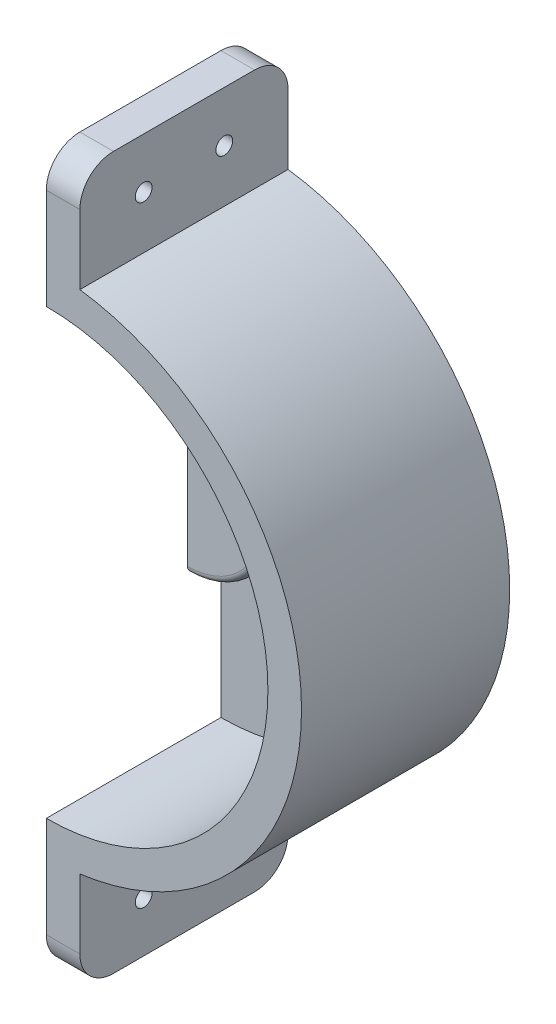
ISO-10303-21;
HEADER;
FILE_DESCRIPTION(('STEP AP214'),'2;1');
FILE_NAME('part.step','',(''),(''),'','','');
FILE_SCHEMA(('AUTOMOTIVE_DESIGN { 1 0 10303 214 1 1 1 1 }'));
ENDSEC;
DATA;
#1=APPLICATION_CONTEXT('core data for automotive mechanical design processes');
#2=APPLICATION_PROTOCOL_DEFINITION('international standard','automotive_design',2000,#1);
#3=PRODUCT_CONTEXT('',#1,'mechanical');
#4=PRODUCT('Part','Part','',(#3));
#5=PRODUCT_RELATED_PRODUCT_CATEGORY('part','',(#4));
#6=PRODUCT_DEFINITION_FORMATION('','',#4);
#7=PRODUCT_DEFINITION_CONTEXT('part definition',#1,'design');
#8=PRODUCT_DEFINITION('design','',#6,#7);
#9=PRODUCT_DEFINITION_SHAPE('','',#8);
#10=(LENGTH_UNIT() NAMED_UNIT(*) SI_UNIT(.MILLI.,.METRE.));
#11=(NAMED_UNIT(*) PLANE_ANGLE_UNIT() SI_UNIT($,.RADIAN.));
#12=(NAMED_UNIT(*) SI_UNIT($,.STERADIAN.) SOLID_ANGLE_UNIT());
#13=UNCERTAINTY_MEASURE_WITH_UNIT(LENGTH_MEASURE(1.E-05),#10,'distance_accuracy_value','');
#14=(GEOMETRIC_REPRESENTATION_CONTEXT(3) GLOBAL_UNCERTAINTY_ASSIGNED_CONTEXT((#13)) GLOBAL_UNIT_ASSIGNED_CONTEXT((#10,
#11,#12)) REPRESENTATION_CONTEXT('',''));
#15=CARTESIAN_POINT('',(0.,0.,0.));
#16=DIRECTION('',(0.,0.,1.));
#17=DIRECTION('',(1.,0.,0.));
#18=AXIS2_PLACEMENT_3D('',#15,#16,#17);
#19=CARTESIAN_POINT('',(0.,0.,5.));
#20=DIRECTION('',(0.,0.,-1.));
#21=DIRECTION('',(-1.,0.,0.));
#22=AXIS2_PLACEMENT_3D('',#19,#20,#21);
#23=CYLINDRICAL_SURFACE('',#22,38.);
#24=DIRECTION('',(0.,0.,-1.));
#25=VECTOR('',#24,1.);
#26=CARTESIAN_POINT('',(4.99999999999998,37.6696164036747,5.));
#27=LINE('',#26,#25);
#28=CARTESIAN_POINT('',(4.99999999999998,37.6696164036747,31.));
#29=VERTEX_POINT('',#28);
#30=CARTESIAN_POINT('',(4.99999999999998,37.6696164036747,0.));
#31=VERTEX_POINT('',#30);
#32=EDGE_CURVE('E139',#29,#31,#27,.T.);
#33=ORIENTED_EDGE('',*,*,#32,.F.);
#34=CARTESIAN_POINT('',(0.,0.,31.));
#35=DIRECTION('',(0.,0.,1.));
#36=DIRECTION('',(1.,0.,0.));
#37=AXIS2_PLACEMENT_3D('',#34,#35,#36);
#38=CIRCLE('',#37,38.);
#39=CARTESIAN_POINT('',(4.99999999999997,-37.6696164036747,31.));
#40=VERTEX_POINT('',#39);
#41=EDGE_CURVE('E143',#40,#29,#38,.T.);
#42=ORIENTED_EDGE('',*,*,#41,.F.);
#43=DIRECTION('',(0.,0.,-1.));
#44=VECTOR('',#43,1.);
#45=CARTESIAN_POINT('',(5.,-37.6696164036747,5.));
#46=LINE('',#45,#44);
#47=CARTESIAN_POINT('',(5.,-37.6696164036747,0.));
#48=VERTEX_POINT('',#47);
#49=EDGE_CURVE('E147',#40,#48,#46,.T.);
#50=ORIENTED_EDGE('',*,*,#49,.T.);
#51=CARTESIAN_POINT('',(0.,0.,0.));
#52=DIRECTION('',(0.,0.,1.));
#53=DIRECTION('',(1.,0.,0.));
#54=AXIS2_PLACEMENT_3D('',#51,#52,#53);
#55=CIRCLE('',#54,38.);
#56=EDGE_CURVE('E145',#48,#31,#55,.T.);
#57=ORIENTED_EDGE('',*,*,#56,.T.);
#58=EDGE_LOOP('',(#33,#42,#50,#57));
#59=FACE_BOUND('',#58,.T.);
#60=ADVANCED_FACE('F32',(#59),#23,.T.);
#61=CARTESIAN_POINT('',(0.,0.,5.));
#62=DIRECTION('',(0.,0.,1.));
#63=DIRECTION('',(1.,0.,0.));
#64=AXIS2_PLACEMENT_3D('',#61,#62,#63);
#65=PLANE('',#64);
#66=DIRECTION('',(0.,-1.,0.));
#67=VECTOR('',#66,1.);
#68=CARTESIAN_POINT('',(0.,38.,5.));
#69=LINE('',#68,#67);
#70=CARTESIAN_POINT('',(0.,33.,5.));
#71=VERTEX_POINT('',#70);
#72=CARTESIAN_POINT('',(0.,12.,5.));
#73=VERTEX_POINT('',#72);
#74=EDGE_CURVE('E188',#71,#73,#69,.T.);
#75=ORIENTED_EDGE('',*,*,#74,.T.);
#76=CARTESIAN_POINT('',(0.,0.,5.));
#77=DIRECTION('',(0.,0.,1.));
#78=DIRECTION('',(1.,0.,0.));
#79=AXIS2_PLACEMENT_3D('',#76,#77,#78);
#80=CIRCLE('',#79,12.);
#81=CARTESIAN_POINT('',(0.,-12.,5.));
#82=VERTEX_POINT('',#81);
#83=EDGE_CURVE('E516',#82,#73,#80,.T.);
#84=ORIENTED_EDGE('',*,*,#83,.F.);
#85=CARTESIAN_POINT('',(0.,-33.,5.));
#86=VERTEX_POINT('',#85);
#87=EDGE_CURVE('E186',#82,#86,#69,.T.);
#88=ORIENTED_EDGE('',*,*,#87,.T.);
#89=CARTESIAN_POINT('',(0.,0.,5.));
#90=DIRECTION('',(0.,0.,-1.));
#91=DIRECTION('',(1.,0.,0.));
#92=AXIS2_PLACEMENT_3D('',#89,#90,#91);
#93=CIRCLE('',#92,33.);
#94=EDGE_CURVE('E166',#71,#86,#93,.T.);
#95=ORIENTED_EDGE('',*,*,#94,.F.);
#96=EDGE_LOOP('',(#75,#84,#88,#95));
#97=FACE_BOUND('',#96,.T.);
#98=ADVANCED_FACE('F290',(#97),#65,.T.);
#99=CARTESIAN_POINT('',(0.,53.,5.));
#100=DIRECTION('',(0.,-1.,0.));
#101=DIRECTION('',(0.,0.,-1.));
#102=AXIS2_PLACEMENT_3D('',#99,#100,#101);
#103=PLANE('',#102);
#104=DIRECTION('',(0.,0.,-1.));
#105=VECTOR('',#104,1.);
#106=CARTESIAN_POINT('',(5.,53.,5.));
#107=LINE('',#106,#105);
#108=CARTESIAN_POINT('',(5.,53.,26.));
#109=VERTEX_POINT('',#108);
#110=CARTESIAN_POINT('',(5.,53.,5.));
#111=VERTEX_POINT('',#110);
#112=EDGE_CURVE('E148',#109,#111,#107,.T.);
#113=ORIENTED_EDGE('',*,*,#112,.T.);
#114=DIRECTION('',(-1.,0.,0.));
#115=VECTOR('',#114,1.);
#116=CARTESIAN_POINT('',(0.,53.,5.));
#117=LINE('',#116,#115);
#118=CARTESIAN_POINT('',(0.,53.,5.));
#119=VERTEX_POINT('',#118);
#120=EDGE_CURVE('E242',#111,#119,#117,.T.);
#121=ORIENTED_EDGE('',*,*,#120,.T.);
#122=DIRECTION('',(0.,0.,-1.));
#123=VECTOR('',#122,1.);
#124=CARTESIAN_POINT('',(0.,53.,5.));
#125=LINE('',#124,#123);
#126=CARTESIAN_POINT('',(0.,53.,26.));
#127=VERTEX_POINT('',#126);
#128=EDGE_CURVE('E204',#127,#119,#125,.T.);
#129=ORIENTED_EDGE('',*,*,#128,.F.);
#130=DIRECTION('',(-1.,0.,0.));
#131=VECTOR('',#130,1.);
#132=CARTESIAN_POINT('',(5.,53.,26.));
#133=LINE('',#132,#131);
#134=EDGE_CURVE('E52',#127,#109,#133,.F.);
#135=ORIENTED_EDGE('',*,*,#134,.T.);
#136=EDGE_LOOP('',(#113,#121,#129,#135));
#137=FACE_BOUND('',#136,.T.);
#138=ADVANCED_FACE('F245',(#137),#103,.F.);
#139=CARTESIAN_POINT('',(0.,-38.,5.));
#140=DIRECTION('',(1.,0.,0.));
#141=DIRECTION('',(0.,0.,-1.));
#142=AXIS2_PLACEMENT_3D('',#139,#140,#141);
#143=PLANE('',#142);
#144=CARTESIAN_POINT('',(0.,-45.5,9.5));
#145=DIRECTION('',(-1.,0.,0.));
#146=DIRECTION('',(0.,0.,-1.));
#147=AXIS2_PLACEMENT_3D('',#144,#145,#146);
#148=CIRCLE('',#147,1.25);
#149=CARTESIAN_POINT('',(0.,-45.5,8.25));
#150=VERTEX_POINT('',#149);
#151=EDGE_CURVE('E533',#150,#150,#148,.T.);
#152=ORIENTED_EDGE('',*,*,#151,.F.);
#153=EDGE_LOOP('',(#152));
#154=FACE_BOUND('',#153,.T.);
#155=CARTESIAN_POINT('',(0.,-45.5,21.5));
#156=DIRECTION('',(-1.,0.,0.));
#157=DIRECTION('',(0.,0.,-1.));
#158=AXIS2_PLACEMENT_3D('',#155,#156,#157);
#159=CIRCLE('',#158,1.25);
#160=CARTESIAN_POINT('',(0.,-45.5,20.25));
#161=VERTEX_POINT('',#160);
#162=EDGE_CURVE('E539',#161,#161,#159,.T.);
#163=ORIENTED_EDGE('',*,*,#162,.F.);
#164=EDGE_LOOP('',(#163));
#165=FACE_BOUND('',#164,.T.);
#166=CARTESIAN_POINT('',(0.,45.5,21.5));
#167=DIRECTION('',(-1.,0.,0.));
#168=DIRECTION('',(0.,0.,1.));
#169=AXIS2_PLACEMENT_3D('',#166,#167,#168);
#170=CIRCLE('',#169,1.25);
#171=CARTESIAN_POINT('',(0.,45.5,22.75));
#172=VERTEX_POINT('',#171);
#173=EDGE_CURVE('E545',#172,#172,#170,.T.);
#174=ORIENTED_EDGE('',*,*,#173,.F.);
#175=EDGE_LOOP('',(#174));
#176=FACE_BOUND('',#175,.T.);
#177=CARTESIAN_POINT('',(0.,45.5,9.5));
#178=DIRECTION('',(-1.,0.,0.));
#179=DIRECTION('',(0.,0.,1.));
#180=AXIS2_PLACEMENT_3D('',#177,#178,#179);
#181=CIRCLE('',#180,1.25);
#182=CARTESIAN_POINT('',(0.,45.5,10.75));
#183=VERTEX_POINT('',#182);
#184=EDGE_CURVE('E527',#183,#183,#181,.T.);
#185=ORIENTED_EDGE('',*,*,#184,.F.);
#186=EDGE_LOOP('',(#185));
#187=FACE_BOUND('',#186,.T.);
#188=DIRECTION('',(0.,0.,-1.));
#189=VECTOR('',#188,1.);
#190=CARTESIAN_POINT('',(0.,-53.,5.));
#191=LINE('',#190,#189);
#192=CARTESIAN_POINT('',(0.,-53.,26.));
#193=VERTEX_POINT('',#192);
#194=CARTESIAN_POINT('',(0.,-53.,5.));
#195=VERTEX_POINT('',#194);
#196=EDGE_CURVE('E201',#193,#195,#191,.T.);
#197=ORIENTED_EDGE('',*,*,#196,.F.);
#198=CARTESIAN_POINT('',(0.,-48.,26.));
#199=DIRECTION('',(1.,0.,0.));
#200=DIRECTION('',(0.,0.,-1.));
#201=AXIS2_PLACEMENT_3D('',#198,#199,#200);
#202=CIRCLE('',#201,5.);
#203=CARTESIAN_POINT('',(0.,-48.,31.));
#204=VERTEX_POINT('',#203);
#205=EDGE_CURVE('E235',#193,#204,#202,.F.);
#206=ORIENTED_EDGE('',*,*,#205,.T.);
#207=DIRECTION('',(0.,-1.,0.));
#208=VECTOR('',#207,1.);
#209=CARTESIAN_POINT('',(0.,-38.,31.));
#210=LINE('',#209,#208);
#211=CARTESIAN_POINT('',(0.,-33.,31.));
#212=VERTEX_POINT('',#211);
#213=EDGE_CURVE('E177',#212,#204,#210,.T.);
#214=ORIENTED_EDGE('',*,*,#213,.F.);
#215=DIRECTION('',(0.,0.,-1.));
#216=VECTOR('',#215,1.);
#217=CARTESIAN_POINT('',(0.,-33.,31.));
#218=LINE('',#217,#216);
#219=EDGE_CURVE('E178',#212,#86,#218,.T.);
#220=ORIENTED_EDGE('',*,*,#219,.T.);
#221=ORIENTED_EDGE('',*,*,#87,.F.);
#222=DIRECTION('',(0.,0.,-1.));
#223=VECTOR('',#222,1.);
#224=CARTESIAN_POINT('',(0.,-12.,10.));
#225=LINE('',#224,#223);
#226=CARTESIAN_POINT('',(0.,-12.,9.));
#227=VERTEX_POINT('',#226);
#228=EDGE_CURVE('E517',#227,#82,#225,.T.);
#229=ORIENTED_EDGE('',*,*,#228,.F.);
#230=CARTESIAN_POINT('',(0.,-11.,9.));
#231=DIRECTION('',(1.,0.,0.));
#232=DIRECTION('',(0.,0.,-1.));
#233=AXIS2_PLACEMENT_3D('',#230,#231,#232);
#234=CIRCLE('',#233,1.);
#235=CARTESIAN_POINT('',(0.,-11.,10.));
#236=VERTEX_POINT('',#235);
#237=EDGE_CURVE('E210',#227,#236,#234,.F.);
#238=ORIENTED_EDGE('',*,*,#237,.T.);
#239=DIRECTION('',(0.,-1.,0.));
#240=VECTOR('',#239,1.);
#241=CARTESIAN_POINT('',(0.,12.,10.));
#242=LINE('',#241,#240);
#243=CARTESIAN_POINT('',(0.,11.,10.));
#244=VERTEX_POINT('',#243);
#245=EDGE_CURVE('E522',#244,#236,#242,.T.);
#246=ORIENTED_EDGE('',*,*,#245,.F.);
#247=CARTESIAN_POINT('',(0.,11.,9.));
#248=DIRECTION('',(1.,0.,0.));
#249=DIRECTION('',(0.,0.,-1.));
#250=AXIS2_PLACEMENT_3D('',#247,#248,#249);
#251=CIRCLE('',#250,1.);
#252=CARTESIAN_POINT('',(0.,12.,9.));
#253=VERTEX_POINT('',#252);
#254=EDGE_CURVE('E212',#244,#253,#251,.F.);
#255=ORIENTED_EDGE('',*,*,#254,.T.);
#256=DIRECTION('',(0.,0.,-1.));
#257=VECTOR('',#256,1.);
#258=CARTESIAN_POINT('',(0.,12.,10.));
#259=LINE('',#258,#257);
#260=EDGE_CURVE('E171',#253,#73,#259,.T.);
#261=ORIENTED_EDGE('',*,*,#260,.T.);
#262=ORIENTED_EDGE('',*,*,#74,.F.);
#263=DIRECTION('',(0.,0.,-1.));
#264=VECTOR('',#263,1.);
#265=CARTESIAN_POINT('',(0.,33.,31.));
#266=LINE('',#265,#264);
#267=CARTESIAN_POINT('',(0.,33.,31.));
#268=VERTEX_POINT('',#267);
#269=EDGE_CURVE('E182',#268,#71,#266,.T.);
#270=ORIENTED_EDGE('',*,*,#269,.F.);
#271=DIRECTION('',(0.,-1.,0.));
#272=VECTOR('',#271,1.);
#273=CARTESIAN_POINT('',(0.,33.,31.));
#274=LINE('',#273,#272);
#275=CARTESIAN_POINT('',(0.,48.,31.));
#276=VERTEX_POINT('',#275);
#277=EDGE_CURVE('E165',#276,#268,#274,.T.);
#278=ORIENTED_EDGE('',*,*,#277,.F.);
#279=CARTESIAN_POINT('',(0.,48.,26.));
#280=DIRECTION('',(1.,0.,0.));
#281=DIRECTION('',(0.,0.,-1.));
#282=AXIS2_PLACEMENT_3D('',#279,#280,#281);
#283=CIRCLE('',#282,5.);
#284=EDGE_CURVE('E229',#276,#127,#283,.F.);
#285=ORIENTED_EDGE('',*,*,#284,.T.);
#286=ORIENTED_EDGE('',*,*,#128,.T.);
#287=CARTESIAN_POINT('',(0.,48.,5.));
#288=DIRECTION('',(1.,0.,0.));
#289=DIRECTION('',(0.,0.,-1.));
#290=AXIS2_PLACEMENT_3D('',#287,#288,#289);
#291=CIRCLE('',#290,5.);
#292=CARTESIAN_POINT('',(0.,48.,0.));
#293=VERTEX_POINT('',#292);
#294=EDGE_CURVE('E231',#119,#293,#291,.F.);
#295=ORIENTED_EDGE('',*,*,#294,.T.);
#296=DIRECTION('',(0.,-1.,0.));
#297=VECTOR('',#296,1.);
#298=CARTESIAN_POINT('',(0.,-38.,0.));
#299=LINE('',#298,#297);
#300=CARTESIAN_POINT('',(0.,-48.,0.));
#301=VERTEX_POINT('',#300);
#302=EDGE_CURVE('E185',#293,#301,#299,.T.);
#303=ORIENTED_EDGE('',*,*,#302,.T.);
#304=CARTESIAN_POINT('',(0.,-48.,5.));
#305=DIRECTION('',(1.,0.,0.));
#306=DIRECTION('',(0.,0.,-1.));
#307=AXIS2_PLACEMENT_3D('',#304,#305,#306);
#308=CIRCLE('',#307,5.);
#309=EDGE_CURVE('E233',#301,#195,#308,.F.);
#310=ORIENTED_EDGE('',*,*,#309,.T.);
#311=EDGE_LOOP('',(#197,#206,#214,#220,#221,#229,#238,#246,#255,#261,#262,#270,#278,#285,#286,
#295,#303,#310));
#312=FACE_BOUND('',#311,.T.);
#313=ADVANCED_FACE('F249',(#154,#165,#176,#187,#312),#143,.F.);
#314=CARTESIAN_POINT('',(0.,-53.,5.));
#315=DIRECTION('',(0.,1.,0.));
#316=DIRECTION('',(0.,0.,1.));
#317=AXIS2_PLACEMENT_3D('',#314,#315,#316);
#318=PLANE('',#317);
#319=DIRECTION('',(0.,0.,-1.));
#320=VECTOR('',#319,1.);
#321=CARTESIAN_POINT('',(5.,-53.,5.));
#322=LINE('',#321,#320);
#323=CARTESIAN_POINT('',(5.,-53.,26.));
#324=VERTEX_POINT('',#323);
#325=CARTESIAN_POINT('',(5.,-53.,5.));
#326=VERTEX_POINT('',#325);
#327=EDGE_CURVE('E198',#324,#326,#322,.T.);
#328=ORIENTED_EDGE('',*,*,#327,.F.);
#329=DIRECTION('',(1.,0.,0.));
#330=VECTOR('',#329,1.);
#331=CARTESIAN_POINT('',(0.,-53.,26.));
#332=LINE('',#331,#330);
#333=EDGE_CURVE('E227',#324,#193,#332,.F.);
#334=ORIENTED_EDGE('',*,*,#333,.T.);
#335=ORIENTED_EDGE('',*,*,#196,.T.);
#336=DIRECTION('',(1.,0.,0.));
#337=VECTOR('',#336,1.);
#338=CARTESIAN_POINT('',(0.,-53.,5.));
#339=LINE('',#338,#337);
#340=EDGE_CURVE('E224',#195,#326,#339,.T.);
#341=ORIENTED_EDGE('',*,*,#340,.T.);
#342=EDGE_LOOP('',(#328,#334,#335,#341));
#343=FACE_BOUND('',#342,.T.);
#344=ADVANCED_FACE('F271',(#343),#318,.F.);
#345=CARTESIAN_POINT('',(5.,-53.,5.));
#346=DIRECTION('',(-1.,0.,0.));
#347=DIRECTION('',(0.,0.,1.));
#348=AXIS2_PLACEMENT_3D('',#345,#346,#347);
#349=PLANE('',#348);
#350=CARTESIAN_POINT('',(5.,-45.5,9.5));
#351=DIRECTION('',(-1.,0.,0.));
#352=DIRECTION('',(0.,0.,-1.));
#353=AXIS2_PLACEMENT_3D('',#350,#351,#352);
#354=CIRCLE('',#353,1.25);
#355=CARTESIAN_POINT('',(5.,-45.5,8.25));
#356=VERTEX_POINT('',#355);
#357=EDGE_CURVE('E536',#356,#356,#354,.T.);
#358=ORIENTED_EDGE('',*,*,#357,.T.);
#359=EDGE_LOOP('',(#358));
#360=FACE_BOUND('',#359,.T.);
#361=CARTESIAN_POINT('',(5.,-45.5,21.5));
#362=DIRECTION('',(-1.,0.,0.));
#363=DIRECTION('',(0.,0.,-1.));
#364=AXIS2_PLACEMENT_3D('',#361,#362,#363);
#365=CIRCLE('',#364,1.25);
#366=CARTESIAN_POINT('',(5.,-45.5,20.25));
#367=VERTEX_POINT('',#366);
#368=EDGE_CURVE('E542',#367,#367,#365,.T.);
#369=ORIENTED_EDGE('',*,*,#368,.T.);
#370=EDGE_LOOP('',(#369));
#371=FACE_BOUND('',#370,.T.);
#372=DIRECTION('',(0.,1.,0.));
#373=VECTOR('',#372,1.);
#374=CARTESIAN_POINT('',(5.,-53.,31.));
#375=LINE('',#374,#373);
#376=CARTESIAN_POINT('',(4.99999999999999,-48.,31.));
#377=VERTEX_POINT('',#376);
#378=EDGE_CURVE('E157',#377,#40,#375,.T.);
#379=ORIENTED_EDGE('',*,*,#378,.F.);
#380=CARTESIAN_POINT('',(5.,-48.,26.));
#381=DIRECTION('',(-1.,0.,0.));
#382=DIRECTION('',(0.,0.,1.));
#383=AXIS2_PLACEMENT_3D('',#380,#381,#382);
#384=CIRCLE('',#383,5.);
#385=EDGE_CURVE('E222',#377,#324,#384,.F.);
#386=ORIENTED_EDGE('',*,*,#385,.T.);
#387=ORIENTED_EDGE('',*,*,#327,.T.);
#388=CARTESIAN_POINT('',(5.,-48.,5.));
#389=DIRECTION('',(-1.,0.,0.));
#390=DIRECTION('',(0.,0.,1.));
#391=AXIS2_PLACEMENT_3D('',#388,#389,#390);
#392=CIRCLE('',#391,5.);
#393=CARTESIAN_POINT('',(5.,-48.,0.));
#394=VERTEX_POINT('',#393);
#395=EDGE_CURVE('E220',#326,#394,#392,.F.);
#396=ORIENTED_EDGE('',*,*,#395,.T.);
#397=DIRECTION('',(0.,1.,0.));
#398=VECTOR('',#397,1.);
#399=CARTESIAN_POINT('',(5.,-53.,0.));
#400=LINE('',#399,#398);
#401=EDGE_CURVE('E192',#394,#48,#400,.T.);
#402=ORIENTED_EDGE('',*,*,#401,.T.);
#403=ORIENTED_EDGE('',*,*,#49,.F.);
#404=EDGE_LOOP('',(#379,#386,#387,#396,#402,#403));
#405=FACE_BOUND('',#404,.T.);
#406=ADVANCED_FACE('F269',(#360,#371,#405),#349,.F.);
#407=CARTESIAN_POINT('',(5.,53.,5.));
#408=DIRECTION('',(-1.,0.,0.));
#409=DIRECTION('',(0.,0.,1.));
#410=AXIS2_PLACEMENT_3D('',#407,#408,#409);
#411=PLANE('',#410);
#412=CARTESIAN_POINT('',(5.,45.5,21.5));
#413=DIRECTION('',(-1.,0.,0.));
#414=DIRECTION('',(0.,0.,1.));
#415=AXIS2_PLACEMENT_3D('',#412,#413,#414);
#416=CIRCLE('',#415,1.25);
#417=CARTESIAN_POINT('',(5.,45.5,22.75));
#418=VERTEX_POINT('',#417);
#419=EDGE_CURVE('E530',#418,#418,#416,.T.);
#420=ORIENTED_EDGE('',*,*,#419,.T.);
#421=EDGE_LOOP('',(#420));
#422=FACE_BOUND('',#421,.T.);
#423=CARTESIAN_POINT('',(5.,45.5,9.5));
#424=DIRECTION('',(-1.,0.,0.));
#425=DIRECTION('',(0.,0.,1.));
#426=AXIS2_PLACEMENT_3D('',#423,#424,#425);
#427=CIRCLE('',#426,1.25);
#428=CARTESIAN_POINT('',(5.,45.5,10.75));
#429=VERTEX_POINT('',#428);
#430=EDGE_CURVE('E158',#429,#429,#427,.T.);
#431=ORIENTED_EDGE('',*,*,#430,.T.);
#432=EDGE_LOOP('',(#431));
#433=FACE_BOUND('',#432,.T.);
#434=DIRECTION('',(0.,1.,0.));
#435=VECTOR('',#434,1.);
#436=CARTESIAN_POINT('',(5.,53.,0.));
#437=LINE('',#436,#435);
#438=CARTESIAN_POINT('',(5.,48.,0.));
#439=VERTEX_POINT('',#438);
#440=EDGE_CURVE('E189',#31,#439,#437,.T.);
#441=ORIENTED_EDGE('',*,*,#440,.T.);
#442=CARTESIAN_POINT('',(5.,48.,5.));
#443=DIRECTION('',(-1.,0.,0.));
#444=DIRECTION('',(0.,0.,1.));
#445=AXIS2_PLACEMENT_3D('',#442,#443,#444);
#446=CIRCLE('',#445,5.);
#447=EDGE_CURVE('E11',#439,#111,#446,.F.);
#448=ORIENTED_EDGE('',*,*,#447,.T.);
#449=ORIENTED_EDGE('',*,*,#112,.F.);
#450=CARTESIAN_POINT('',(5.,48.,26.));
#451=DIRECTION('',(-1.,0.,0.));
#452=DIRECTION('',(0.,0.,1.));
#453=AXIS2_PLACEMENT_3D('',#450,#451,#452);
#454=CIRCLE('',#453,5.);
#455=CARTESIAN_POINT('',(4.99999999999999,48.,31.));
#456=VERTEX_POINT('',#455);
#457=EDGE_CURVE('E40',#109,#456,#454,.F.);
#458=ORIENTED_EDGE('',*,*,#457,.T.);
#459=DIRECTION('',(0.,1.,0.));
#460=VECTOR('',#459,1.);
#461=CARTESIAN_POINT('',(4.99999999999998,37.6696164036747,31.));
#462=LINE('',#461,#460);
#463=EDGE_CURVE('E151',#29,#456,#462,.T.);
#464=ORIENTED_EDGE('',*,*,#463,.F.);
#465=ORIENTED_EDGE('',*,*,#32,.T.);
#466=EDGE_LOOP('',(#441,#448,#449,#458,#464,#465));
#467=FACE_BOUND('',#466,.T.);
#468=ADVANCED_FACE('F152',(#422,#433,#467),#411,.F.);
#469=CARTESIAN_POINT('',(0.,0.,0.));
#470=DIRECTION('',(0.,0.,1.));
#471=DIRECTION('',(1.,0.,0.));
#472=AXIS2_PLACEMENT_3D('',#469,#470,#471);
#473=PLANE('',#472);
#474=ORIENTED_EDGE('',*,*,#401,.F.);
#475=DIRECTION('',(1.,0.,0.));
#476=VECTOR('',#475,1.);
#477=CARTESIAN_POINT('',(0.,-48.,0.));
#478=LINE('',#477,#476);
#479=EDGE_CURVE('E239',#394,#301,#478,.F.);
#480=ORIENTED_EDGE('',*,*,#479,.T.);
#481=ORIENTED_EDGE('',*,*,#302,.F.);
#482=DIRECTION('',(-1.,0.,0.));
#483=VECTOR('',#482,1.);
#484=CARTESIAN_POINT('',(0.,48.,0.));
#485=LINE('',#484,#483);
#486=EDGE_CURVE('E237',#293,#439,#485,.F.);
#487=ORIENTED_EDGE('',*,*,#486,.T.);
#488=ORIENTED_EDGE('',*,*,#440,.F.);
#489=ORIENTED_EDGE('',*,*,#56,.F.);
#490=EDGE_LOOP('',(#474,#480,#481,#487,#488,#489));
#491=FACE_BOUND('',#490,.T.);
#492=ADVANCED_FACE('F279',(#491),#473,.F.);
#493=CARTESIAN_POINT('',(0.,0.,31.));
#494=DIRECTION('',(0.,0.,-1.));
#495=DIRECTION('',(-1.,0.,0.));
#496=AXIS2_PLACEMENT_3D('',#493,#494,#495);
#497=CYLINDRICAL_SURFACE('',#496,33.);
#498=ORIENTED_EDGE('',*,*,#94,.T.);
#499=ORIENTED_EDGE('',*,*,#219,.F.);
#500=CARTESIAN_POINT('',(0.,0.,31.));
#501=DIRECTION('',(0.,0.,-1.));
#502=DIRECTION('',(1.,0.,0.));
#503=AXIS2_PLACEMENT_3D('',#500,#501,#502);
#504=CIRCLE('',#503,33.);
#505=EDGE_CURVE('E168',#268,#212,#504,.T.);
#506=ORIENTED_EDGE('',*,*,#505,.F.);
#507=ORIENTED_EDGE('',*,*,#269,.T.);
#508=EDGE_LOOP('',(#498,#499,#506,#507));
#509=FACE_BOUND('',#508,.T.);
#510=ADVANCED_FACE('F259',(#509),#497,.F.);
#511=CARTESIAN_POINT('',(0.,0.,31.));
#512=DIRECTION('',(0.,0.,1.));
#513=DIRECTION('',(1.,0.,0.));
#514=AXIS2_PLACEMENT_3D('',#511,#512,#513);
#515=PLANE('',#514);
#516=ORIENTED_EDGE('',*,*,#213,.T.);
#517=DIRECTION('',(1.,0.,0.));
#518=VECTOR('',#517,1.);
#519=CARTESIAN_POINT('',(5.,-48.,31.));
#520=LINE('',#519,#518);
#521=EDGE_CURVE('E218',#204,#377,#520,.T.);
#522=ORIENTED_EDGE('',*,*,#521,.T.);
#523=ORIENTED_EDGE('',*,*,#378,.T.);
#524=ORIENTED_EDGE('',*,*,#41,.T.);
#525=ORIENTED_EDGE('',*,*,#463,.T.);
#526=DIRECTION('',(-1.,0.,0.));
#527=VECTOR('',#526,1.);
#528=CARTESIAN_POINT('',(0.,48.,31.));
#529=LINE('',#528,#527);
#530=EDGE_CURVE('E216',#456,#276,#529,.T.);
#531=ORIENTED_EDGE('',*,*,#530,.T.);
#532=ORIENTED_EDGE('',*,*,#277,.T.);
#533=ORIENTED_EDGE('',*,*,#505,.T.);
#534=EDGE_LOOP('',(#516,#522,#523,#524,#525,#531,#532,#533));
#535=FACE_BOUND('',#534,.T.);
#536=ADVANCED_FACE('F161',(#535),#515,.T.);
#537=CARTESIAN_POINT('',(0.,0.,10.));
#538=DIRECTION('',(0.,0.,-1.));
#539=DIRECTION('',(-1.,0.,0.));
#540=AXIS2_PLACEMENT_3D('',#537,#538,#539);
#541=CYLINDRICAL_SURFACE('',#540,12.);
#542=ORIENTED_EDGE('',*,*,#260,.F.);
#543=CARTESIAN_POINT('',(0.,0.,9.));
#544=DIRECTION('',(0.,0.,1.));
#545=DIRECTION('',(1.,0.,0.));
#546=AXIS2_PLACEMENT_3D('',#543,#544,#545);
#547=CIRCLE('',#546,12.);
#548=EDGE_CURVE('E214',#253,#227,#547,.F.);
#549=ORIENTED_EDGE('',*,*,#548,.T.);
#550=ORIENTED_EDGE('',*,*,#228,.T.);
#551=ORIENTED_EDGE('',*,*,#83,.T.);
#552=EDGE_LOOP('',(#542,#549,#550,#551));
#553=FACE_BOUND('',#552,.T.);
#554=ADVANCED_FACE('F409',(#553),#541,.T.);
#555=CARTESIAN_POINT('',(0.,0.,10.));
#556=DIRECTION('',(0.,0.,1.));
#557=DIRECTION('',(1.,0.,0.));
#558=AXIS2_PLACEMENT_3D('',#555,#556,#557);
#559=PLANE('',#558);
#560=ORIENTED_EDGE('',*,*,#245,.T.);
#561=CARTESIAN_POINT('',(0.,0.,10.));
#562=DIRECTION('',(0.,0.,1.));
#563=DIRECTION('',(1.,0.,0.));
#564=AXIS2_PLACEMENT_3D('',#561,#562,#563);
#565=CIRCLE('',#564,11.);
#566=EDGE_CURVE('E207',#236,#244,#565,.T.);
#567=ORIENTED_EDGE('',*,*,#566,.T.);
#568=EDGE_LOOP('',(#560,#567));
#569=FACE_BOUND('',#568,.T.);
#570=ADVANCED_FACE('F313',(#569),#559,.T.);
#571=CARTESIAN_POINT('',(0.,0.,9.));
#572=DIRECTION('',(0.,0.,1.));
#573=DIRECTION('',(1.,0.,0.));
#574=AXIS2_PLACEMENT_3D('',#571,#572,#573);
#575=TOROIDAL_SURFACE('',#574,11.,1.);
#576=ORIENTED_EDGE('',*,*,#237,.F.);
#577=ORIENTED_EDGE('',*,*,#548,.F.);
#578=ORIENTED_EDGE('',*,*,#254,.F.);
#579=ORIENTED_EDGE('',*,*,#566,.F.);
#580=EDGE_LOOP('',(#576,#577,#578,#579));
#581=FACE_BOUND('',#580,.T.);
#582=ADVANCED_FACE('F310',(#581),#575,.T.);
#583=CARTESIAN_POINT('',(0.,-48.,26.));
#584=DIRECTION('',(-1.,0.,0.));
#585=DIRECTION('',(0.,0.,1.));
#586=AXIS2_PLACEMENT_3D('',#583,#584,#585);
#587=CYLINDRICAL_SURFACE('',#586,5.);
#588=ORIENTED_EDGE('',*,*,#205,.F.);
#589=ORIENTED_EDGE('',*,*,#333,.F.);
#590=ORIENTED_EDGE('',*,*,#385,.F.);
#591=ORIENTED_EDGE('',*,*,#521,.F.);
#592=EDGE_LOOP('',(#588,#589,#590,#591));
#593=FACE_BOUND('',#592,.T.);
#594=ADVANCED_FACE('F265',(#593),#587,.T.);
#595=CARTESIAN_POINT('',(0.,-48.,5.));
#596=DIRECTION('',(1.,0.,0.));
#597=DIRECTION('',(0.,0.,-1.));
#598=AXIS2_PLACEMENT_3D('',#595,#596,#597);
#599=CYLINDRICAL_SURFACE('',#598,5.);
#600=ORIENTED_EDGE('',*,*,#309,.F.);
#601=ORIENTED_EDGE('',*,*,#479,.F.);
#602=ORIENTED_EDGE('',*,*,#395,.F.);
#603=ORIENTED_EDGE('',*,*,#340,.F.);
#604=EDGE_LOOP('',(#600,#601,#602,#603));
#605=FACE_BOUND('',#604,.T.);
#606=ADVANCED_FACE('F275',(#605),#599,.T.);
#607=CARTESIAN_POINT('',(0.,48.,5.));
#608=DIRECTION('',(-1.,0.,0.));
#609=DIRECTION('',(0.,0.,1.));
#610=AXIS2_PLACEMENT_3D('',#607,#608,#609);
#611=CYLINDRICAL_SURFACE('',#610,5.);
#612=ORIENTED_EDGE('',*,*,#447,.F.);
#613=ORIENTED_EDGE('',*,*,#486,.F.);
#614=ORIENTED_EDGE('',*,*,#294,.F.);
#615=ORIENTED_EDGE('',*,*,#120,.F.);
#616=EDGE_LOOP('',(#612,#613,#614,#615));
#617=FACE_BOUND('',#616,.T.);
#618=ADVANCED_FACE('F281',(#617),#611,.T.);
#619=CARTESIAN_POINT('',(0.,48.,26.));
#620=DIRECTION('',(1.,0.,0.));
#621=DIRECTION('',(0.,0.,-1.));
#622=AXIS2_PLACEMENT_3D('',#619,#620,#621);
#623=CYLINDRICAL_SURFACE('',#622,5.);
#624=ORIENTED_EDGE('',*,*,#457,.F.);
#625=ORIENTED_EDGE('',*,*,#134,.F.);
#626=ORIENTED_EDGE('',*,*,#284,.F.);
#627=ORIENTED_EDGE('',*,*,#530,.F.);
#628=EDGE_LOOP('',(#624,#625,#626,#627));
#629=FACE_BOUND('',#628,.T.);
#630=ADVANCED_FACE('F34',(#629),#623,.T.);
#631=CARTESIAN_POINT('',(5.,45.5,9.5));
#632=DIRECTION('',(-1.,0.,0.));
#633=DIRECTION('',(0.,0.,1.));
#634=AXIS2_PLACEMENT_3D('',#631,#632,#633);
#635=CYLINDRICAL_SURFACE('',#634,1.25);
#636=ORIENTED_EDGE('',*,*,#430,.F.);
#637=EDGE_LOOP('',(#636));
#638=FACE_BOUND('',#637,.T.);
#639=ORIENTED_EDGE('',*,*,#184,.T.);
#640=EDGE_LOOP('',(#639));
#641=FACE_BOUND('',#640,.T.);
#642=ADVANCED_FACE('F287',(#638,#641),#635,.F.);
#643=CARTESIAN_POINT('',(5.,45.5,21.5));
#644=DIRECTION('',(-1.,0.,0.));
#645=DIRECTION('',(0.,0.,1.));
#646=AXIS2_PLACEMENT_3D('',#643,#644,#645);
#647=CYLINDRICAL_SURFACE('',#646,1.25);
#648=ORIENTED_EDGE('',*,*,#419,.F.);
#649=EDGE_LOOP('',(#648));
#650=FACE_BOUND('',#649,.T.);
#651=ORIENTED_EDGE('',*,*,#173,.T.);
#652=EDGE_LOOP('',(#651));
#653=FACE_BOUND('',#652,.T.);
#654=ADVANCED_FACE('F371',(#650,#653),#647,.F.);
#655=CARTESIAN_POINT('',(5.,-45.5,21.5));
#656=DIRECTION('',(-1.,0.,0.));
#657=DIRECTION('',(0.,0.,1.));
#658=AXIS2_PLACEMENT_3D('',#655,#656,#657);
#659=CYLINDRICAL_SURFACE('',#658,1.25);
#660=ORIENTED_EDGE('',*,*,#368,.F.);
#661=EDGE_LOOP('',(#660));
#662=FACE_BOUND('',#661,.T.);
#663=ORIENTED_EDGE('',*,*,#162,.T.);
#664=EDGE_LOOP('',(#663));
#665=FACE_BOUND('',#664,.T.);
#666=ADVANCED_FACE('F381',(#662,#665),#659,.F.);
#667=CARTESIAN_POINT('',(5.,-45.5,9.5));
#668=DIRECTION('',(-1.,0.,0.));
#669=DIRECTION('',(0.,0.,1.));
#670=AXIS2_PLACEMENT_3D('',#667,#668,#669);
#671=CYLINDRICAL_SURFACE('',#670,1.25);
#672=ORIENTED_EDGE('',*,*,#357,.F.);
#673=EDGE_LOOP('',(#672));
#674=FACE_BOUND('',#673,.T.);
#675=ORIENTED_EDGE('',*,*,#151,.T.);
#676=EDGE_LOOP('',(#675));
#677=FACE_BOUND('',#676,.T.);
#678=ADVANCED_FACE('F391',(#674,#677),#671,.F.);
#679=CLOSED_SHELL('',(#60,#98,#138,#313,#344,#406,#468,#492,#510,#536,#554,#570,#582,#594,#606,
#618,#630,#642,#654,#666,#678));
#680=MANIFOLD_SOLID_BREP('B2',#679);
#681=ADVANCED_BREP_SHAPE_REPRESENTATION('',(#18,#680),#14);
#682=SHAPE_DEFINITION_REPRESENTATION(#9,#681);
ENDSEC;
END-ISO-10303-21;
